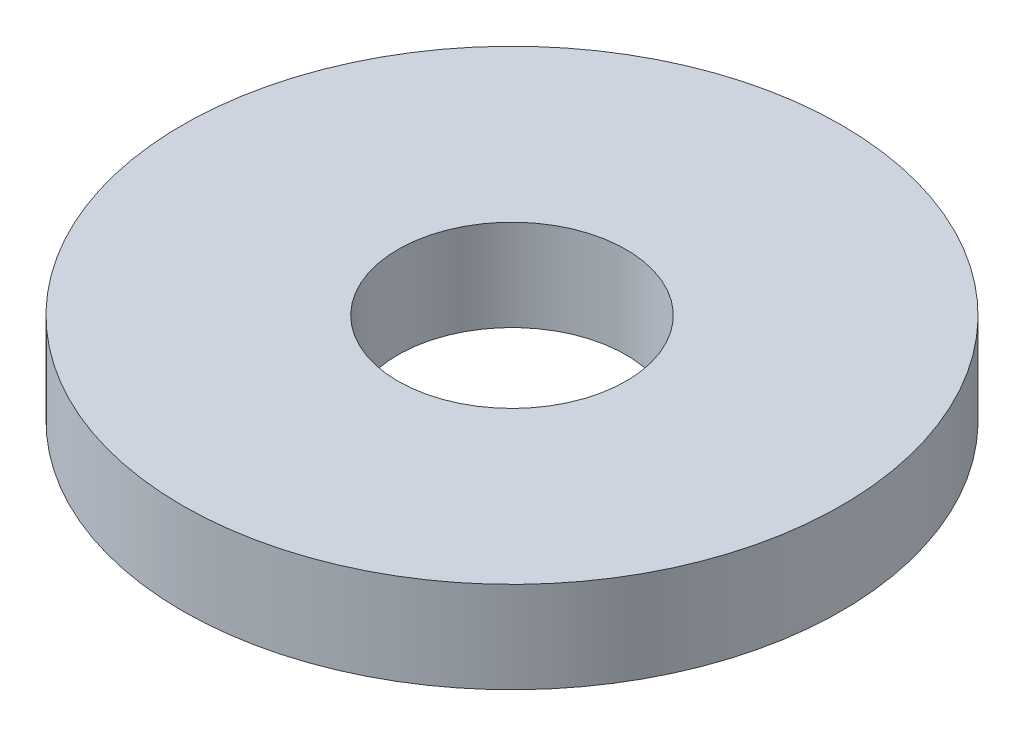
ISO-10303-21;
HEADER;
FILE_DESCRIPTION(('STEP AP214'),'2;1');
FILE_NAME('part.step','',(''),(''),'','','');
FILE_SCHEMA(('AUTOMOTIVE_DESIGN { 1 0 10303 214 1 1 1 1 }'));
ENDSEC;
DATA;
#1=APPLICATION_CONTEXT('core data for automotive mechanical design processes');
#2=APPLICATION_PROTOCOL_DEFINITION('international standard','automotive_design',2000,#1);
#3=PRODUCT_CONTEXT('',#1,'mechanical');
#4=PRODUCT('Part','Part','',(#3));
#5=PRODUCT_RELATED_PRODUCT_CATEGORY('part','',(#4));
#6=PRODUCT_DEFINITION_FORMATION('','',#4);
#7=PRODUCT_DEFINITION_CONTEXT('part definition',#1,'design');
#8=PRODUCT_DEFINITION('design','',#6,#7);
#9=PRODUCT_DEFINITION_SHAPE('','',#8);
#10=(LENGTH_UNIT() NAMED_UNIT(*) SI_UNIT(.MILLI.,.METRE.));
#11=(NAMED_UNIT(*) PLANE_ANGLE_UNIT() SI_UNIT($,.RADIAN.));
#12=(NAMED_UNIT(*) SI_UNIT($,.STERADIAN.) SOLID_ANGLE_UNIT());
#13=UNCERTAINTY_MEASURE_WITH_UNIT(LENGTH_MEASURE(1.E-05),#10,'distance_accuracy_value','');
#14=(GEOMETRIC_REPRESENTATION_CONTEXT(3) GLOBAL_UNCERTAINTY_ASSIGNED_CONTEXT((#13)) GLOBAL_UNIT_ASSIGNED_CONTEXT((#10,
#11,#12)) REPRESENTATION_CONTEXT('',''));
#15=CARTESIAN_POINT('',(0.,0.,0.));
#16=DIRECTION('',(0.,0.,1.));
#17=DIRECTION('',(1.,0.,0.));
#18=AXIS2_PLACEMENT_3D('',#15,#16,#17);
#19=CARTESIAN_POINT('',(0.,18.,0.));
#20=DIRECTION('',(0.,-1.,0.));
#21=DIRECTION('',(0.,0.,-1.));
#22=AXIS2_PLACEMENT_3D('',#19,#20,#21);
#23=CYLINDRICAL_SURFACE('',#22,65.);
#24=CARTESIAN_POINT('',(0.,18.,0.));
#25=DIRECTION('',(0.,1.,0.));
#26=DIRECTION('',(0.,0.,1.));
#27=AXIS2_PLACEMENT_3D('',#24,#25,#26);
#28=CIRCLE('',#27,65.);
#29=CARTESIAN_POINT('',(0.,18.,65.));
#30=VERTEX_POINT('',#29);
#31=EDGE_CURVE('E10',#30,#30,#28,.T.);
#32=ORIENTED_EDGE('',*,*,#31,.F.);
#33=EDGE_LOOP('',(#32));
#34=FACE_BOUND('',#33,.T.);
#35=CARTESIAN_POINT('',(0.,0.,0.));
#36=DIRECTION('',(0.,1.,0.));
#37=DIRECTION('',(0.,0.,1.));
#38=AXIS2_PLACEMENT_3D('',#35,#36,#37);
#39=CIRCLE('',#38,65.);
#40=CARTESIAN_POINT('',(0.,0.,65.));
#41=VERTEX_POINT('',#40);
#42=EDGE_CURVE('E37',#41,#41,#39,.T.);
#43=ORIENTED_EDGE('',*,*,#42,.T.);
#44=EDGE_LOOP('',(#43));
#45=FACE_BOUND('',#44,.T.);
#46=ADVANCED_FACE('F40',(#34,#45),#23,.T.);
#47=CARTESIAN_POINT('',(0.,18.,0.));
#48=DIRECTION('',(0.,1.,0.));
#49=DIRECTION('',(0.,0.,1.));
#50=AXIS2_PLACEMENT_3D('',#47,#48,#49);
#51=PLANE('',#50);
#52=CARTESIAN_POINT('',(0.,18.,0.));
#53=DIRECTION('',(0.,1.,0.));
#54=DIRECTION('',(0.,0.,1.));
#55=AXIS2_PLACEMENT_3D('',#52,#53,#54);
#56=CIRCLE('',#55,22.5);
#57=CARTESIAN_POINT('',(0.,18.,22.5));
#58=VERTEX_POINT('',#57);
#59=EDGE_CURVE('E50',#58,#58,#56,.T.);
#60=ORIENTED_EDGE('',*,*,#59,.F.);
#61=EDGE_LOOP('',(#60));
#62=FACE_BOUND('',#61,.T.);
#63=ORIENTED_EDGE('',*,*,#31,.T.);
#64=EDGE_LOOP('',(#63));
#65=FACE_BOUND('',#64,.T.);
#66=ADVANCED_FACE('F59',(#62,#65),#51,.T.);
#67=CARTESIAN_POINT('',(0.,0.,0.));
#68=DIRECTION('',(0.,1.,0.));
#69=DIRECTION('',(0.,0.,1.));
#70=AXIS2_PLACEMENT_3D('',#67,#68,#69);
#71=PLANE('',#70);
#72=CARTESIAN_POINT('',(0.,0.,0.));
#73=DIRECTION('',(0.,1.,0.));
#74=DIRECTION('',(0.,0.,1.));
#75=AXIS2_PLACEMENT_3D('',#72,#73,#74);
#76=CIRCLE('',#75,22.5);
#77=CARTESIAN_POINT('',(0.,0.,22.5));
#78=VERTEX_POINT('',#77);
#79=EDGE_CURVE('E47',#78,#78,#76,.T.);
#80=ORIENTED_EDGE('',*,*,#79,.T.);
#81=EDGE_LOOP('',(#80));
#82=FACE_BOUND('',#81,.T.);
#83=ORIENTED_EDGE('',*,*,#42,.F.);
#84=EDGE_LOOP('',(#83));
#85=FACE_BOUND('',#84,.T.);
#86=ADVANCED_FACE('F58',(#82,#85),#71,.F.);
#87=CARTESIAN_POINT('',(0.,18.,0.));
#88=DIRECTION('',(0.,-1.,0.));
#89=DIRECTION('',(0.,0.,-1.));
#90=AXIS2_PLACEMENT_3D('',#87,#88,#89);
#91=CYLINDRICAL_SURFACE('',#90,22.5);
#92=ORIENTED_EDGE('',*,*,#59,.T.);
#93=EDGE_LOOP('',(#92));
#94=FACE_BOUND('',#93,.T.);
#95=ORIENTED_EDGE('',*,*,#79,.F.);
#96=EDGE_LOOP('',(#95));
#97=FACE_BOUND('',#96,.T.);
#98=ADVANCED_FACE('F54',(#94,#97),#91,.F.);
#99=CLOSED_SHELL('',(#46,#66,#86,#98));
#100=MANIFOLD_SOLID_BREP('B2',#99);
#101=ADVANCED_BREP_SHAPE_REPRESENTATION('',(#18,#100),#14);
#102=SHAPE_DEFINITION_REPRESENTATION(#9,#101);
ENDSEC;
END-ISO-10303-21;
